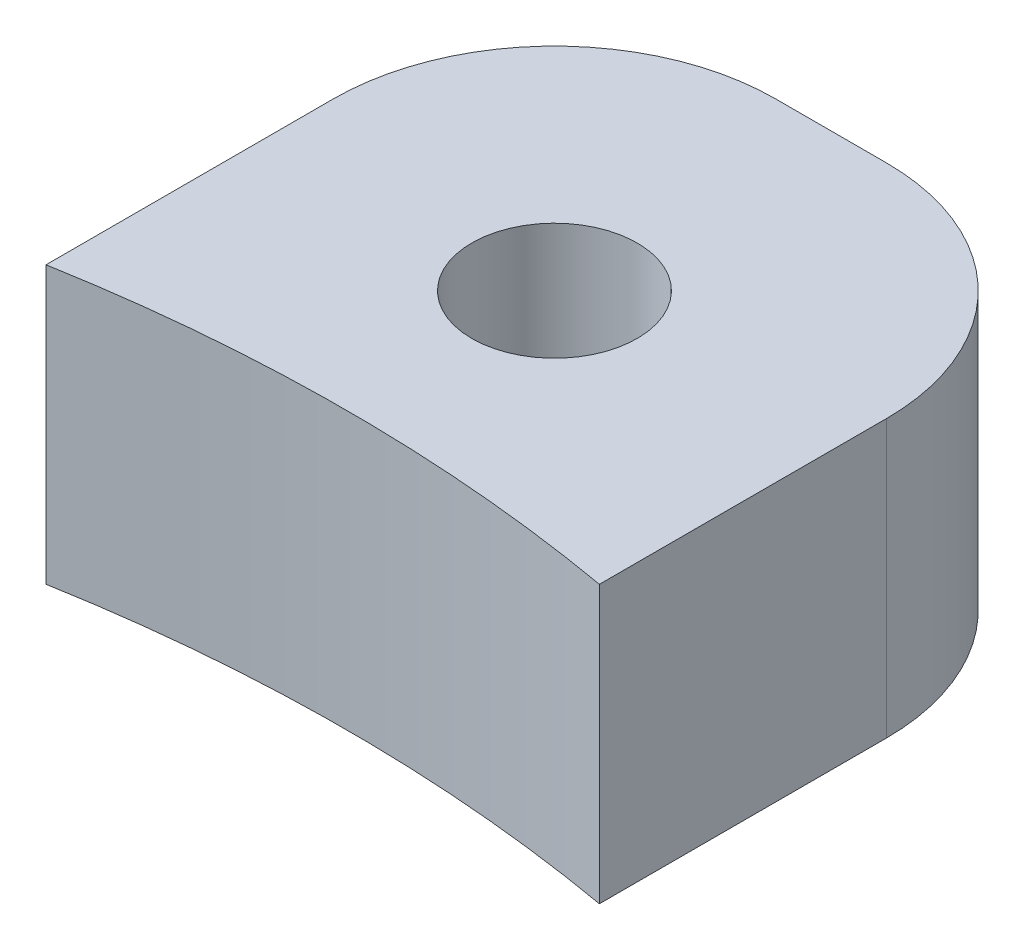
ISO-10303-21;
HEADER;
FILE_DESCRIPTION(('STEP AP214'),'2;1');
FILE_NAME('part.step','',(''),(''),'','','');
FILE_SCHEMA(('AUTOMOTIVE_DESIGN { 1 0 10303 214 1 1 1 1 }'));
ENDSEC;
DATA;
#1=APPLICATION_CONTEXT('core data for automotive mechanical design processes');
#2=APPLICATION_PROTOCOL_DEFINITION('international standard','automotive_design',2000,#1);
#3=PRODUCT_CONTEXT('',#1,'mechanical');
#4=PRODUCT('Part','Part','',(#3));
#5=PRODUCT_RELATED_PRODUCT_CATEGORY('part','',(#4));
#6=PRODUCT_DEFINITION_FORMATION('','',#4);
#7=PRODUCT_DEFINITION_CONTEXT('part definition',#1,'design');
#8=PRODUCT_DEFINITION('design','',#6,#7);
#9=PRODUCT_DEFINITION_SHAPE('','',#8);
#10=(LENGTH_UNIT() NAMED_UNIT(*) SI_UNIT(.MILLI.,.METRE.));
#11=(NAMED_UNIT(*) PLANE_ANGLE_UNIT() SI_UNIT($,.RADIAN.));
#12=(NAMED_UNIT(*) SI_UNIT($,.STERADIAN.) SOLID_ANGLE_UNIT());
#13=UNCERTAINTY_MEASURE_WITH_UNIT(LENGTH_MEASURE(1.E-05),#10,'distance_accuracy_value','');
#14=(GEOMETRIC_REPRESENTATION_CONTEXT(3) GLOBAL_UNCERTAINTY_ASSIGNED_CONTEXT((#13)) GLOBAL_UNIT_ASSIGNED_CONTEXT((#10,
#11,#12)) REPRESENTATION_CONTEXT('',''));
#15=CARTESIAN_POINT('',(0.,0.,0.));
#16=DIRECTION('',(0.,0.,1.));
#17=DIRECTION('',(1.,0.,0.));
#18=AXIS2_PLACEMENT_3D('',#15,#16,#17);
#19=CARTESIAN_POINT('',(6.35,6.35,-17.145));
#20=DIRECTION('',(-1.,0.,0.));
#21=DIRECTION('',(0.,0.,1.));
#22=AXIS2_PLACEMENT_3D('',#19,#20,#21);
#23=PLANE('',#22);
#24=DIRECTION('',(0.,0.,-1.));
#25=VECTOR('',#24,1.);
#26=CARTESIAN_POINT('',(6.35,6.35,-17.145));
#27=LINE('',#26,#25);
#28=CARTESIAN_POINT('',(6.35,6.35,-10.5560864979769));
#29=VERTEX_POINT('',#28);
#30=CARTESIAN_POINT('',(6.35,6.35,-17.145));
#31=VERTEX_POINT('',#30);
#32=EDGE_CURVE('E101',#29,#31,#27,.T.);
#33=ORIENTED_EDGE('',*,*,#32,.F.);
#34=DIRECTION('',(0.,1.,0.));
#35=VECTOR('',#34,1.);
#36=CARTESIAN_POINT('',(6.35,0.,-10.5560864979769));
#37=LINE('',#36,#35);
#38=CARTESIAN_POINT('',(6.35,0.,-10.5560864979769));
#39=VERTEX_POINT('',#38);
#40=EDGE_CURVE('E88',#29,#39,#37,.F.);
#41=ORIENTED_EDGE('',*,*,#40,.T.);
#42=DIRECTION('',(0.,0.,-1.));
#43=VECTOR('',#42,1.);
#44=CARTESIAN_POINT('',(6.35,0.,-17.145));
#45=LINE('',#44,#43);
#46=CARTESIAN_POINT('',(6.35,0.,-17.145));
#47=VERTEX_POINT('',#46);
#48=EDGE_CURVE('E99',#39,#47,#45,.T.);
#49=ORIENTED_EDGE('',*,*,#48,.T.);
#50=DIRECTION('',(0.,-1.,0.));
#51=VECTOR('',#50,1.);
#52=CARTESIAN_POINT('',(6.35,6.35,-17.145));
#53=LINE('',#52,#51);
#54=EDGE_CURVE('E11',#31,#47,#53,.T.);
#55=ORIENTED_EDGE('',*,*,#54,.F.);
#56=EDGE_LOOP('',(#33,#41,#49,#55));
#57=FACE_BOUND('',#56,.T.);
#58=ADVANCED_FACE('F34',(#57),#23,.F.);
#59=CARTESIAN_POINT('',(1.27,6.35,-17.145));
#60=DIRECTION('',(0.,-1.,0.));
#61=DIRECTION('',(0.,0.,-1.));
#62=AXIS2_PLACEMENT_3D('',#59,#60,#61);
#63=CYLINDRICAL_SURFACE('',#62,5.08);
#64=CARTESIAN_POINT('',(1.27,0.,-17.145));
#65=DIRECTION('',(0.,1.,0.));
#66=DIRECTION('',(0.,0.,1.));
#67=AXIS2_PLACEMENT_3D('',#64,#65,#66);
#68=CIRCLE('',#67,5.08);
#69=CARTESIAN_POINT('',(1.27,0.,-22.225));
#70=VERTEX_POINT('',#69);
#71=EDGE_CURVE('E105',#47,#70,#68,.T.);
#72=ORIENTED_EDGE('',*,*,#71,.T.);
#73=DIRECTION('',(0.,-1.,0.));
#74=VECTOR('',#73,1.);
#75=CARTESIAN_POINT('',(1.27,6.35,-22.225));
#76=LINE('',#75,#74);
#77=CARTESIAN_POINT('',(1.27,6.35,-22.225));
#78=VERTEX_POINT('',#77);
#79=EDGE_CURVE('E42',#78,#70,#76,.T.);
#80=ORIENTED_EDGE('',*,*,#79,.F.);
#81=CARTESIAN_POINT('',(1.27,6.35,-17.145));
#82=DIRECTION('',(0.,1.,0.));
#83=DIRECTION('',(0.,0.,1.));
#84=AXIS2_PLACEMENT_3D('',#81,#82,#83);
#85=CIRCLE('',#84,5.08);
#86=EDGE_CURVE('E117',#31,#78,#85,.T.);
#87=ORIENTED_EDGE('',*,*,#86,.F.);
#88=ORIENTED_EDGE('',*,*,#54,.T.);
#89=EDGE_LOOP('',(#72,#80,#87,#88));
#90=FACE_BOUND('',#89,.T.);
#91=ADVANCED_FACE('F165',(#90),#63,.T.);
#92=CARTESIAN_POINT('',(-1.27,6.35,-22.225));
#93=DIRECTION('',(0.,0.,1.));
#94=DIRECTION('',(1.,0.,0.));
#95=AXIS2_PLACEMENT_3D('',#92,#93,#94);
#96=PLANE('',#95);
#97=DIRECTION('',(-1.,0.,0.));
#98=VECTOR('',#97,1.);
#99=CARTESIAN_POINT('',(-1.27,0.,-22.225));
#100=LINE('',#99,#98);
#101=CARTESIAN_POINT('',(-1.27,0.,-22.225));
#102=VERTEX_POINT('',#101);
#103=EDGE_CURVE('E107',#70,#102,#100,.T.);
#104=ORIENTED_EDGE('',*,*,#103,.T.);
#105=DIRECTION('',(0.,-1.,0.));
#106=VECTOR('',#105,1.);
#107=CARTESIAN_POINT('',(-1.27,6.35,-22.225));
#108=LINE('',#107,#106);
#109=CARTESIAN_POINT('',(-1.27,6.35,-22.225));
#110=VERTEX_POINT('',#109);
#111=EDGE_CURVE('E127',#110,#102,#108,.T.);
#112=ORIENTED_EDGE('',*,*,#111,.F.);
#113=DIRECTION('',(-1.,0.,0.));
#114=VECTOR('',#113,1.);
#115=CARTESIAN_POINT('',(-1.27,6.35,-22.225));
#116=LINE('',#115,#114);
#117=EDGE_CURVE('E119',#78,#110,#116,.T.);
#118=ORIENTED_EDGE('',*,*,#117,.F.);
#119=ORIENTED_EDGE('',*,*,#79,.T.);
#120=EDGE_LOOP('',(#104,#112,#118,#119));
#121=FACE_BOUND('',#120,.T.);
#122=ADVANCED_FACE('F134',(#121),#96,.F.);
#123=CARTESIAN_POINT('',(-1.27,6.35,-17.145));
#124=DIRECTION('',(0.,-1.,0.));
#125=DIRECTION('',(0.,0.,-1.));
#126=AXIS2_PLACEMENT_3D('',#123,#124,#125);
#127=CYLINDRICAL_SURFACE('',#126,5.08);
#128=CARTESIAN_POINT('',(-1.27,0.,-17.145));
#129=DIRECTION('',(0.,1.,0.));
#130=DIRECTION('',(0.,0.,1.));
#131=AXIS2_PLACEMENT_3D('',#128,#129,#130);
#132=CIRCLE('',#131,5.08);
#133=CARTESIAN_POINT('',(-6.35,0.,-17.145));
#134=VERTEX_POINT('',#133);
#135=EDGE_CURVE('E112',#102,#134,#132,.T.);
#136=ORIENTED_EDGE('',*,*,#135,.T.);
#137=DIRECTION('',(0.,-1.,0.));
#138=VECTOR('',#137,1.);
#139=CARTESIAN_POINT('',(-6.35,6.35,-17.145));
#140=LINE('',#139,#138);
#141=CARTESIAN_POINT('',(-6.35,6.35,-17.145));
#142=VERTEX_POINT('',#141);
#143=EDGE_CURVE('E124',#142,#134,#140,.T.);
#144=ORIENTED_EDGE('',*,*,#143,.F.);
#145=CARTESIAN_POINT('',(-1.27,6.35,-17.145));
#146=DIRECTION('',(0.,1.,0.));
#147=DIRECTION('',(0.,0.,1.));
#148=AXIS2_PLACEMENT_3D('',#145,#146,#147);
#149=CIRCLE('',#148,5.08);
#150=EDGE_CURVE('E57',#110,#142,#149,.T.);
#151=ORIENTED_EDGE('',*,*,#150,.F.);
#152=ORIENTED_EDGE('',*,*,#111,.T.);
#153=EDGE_LOOP('',(#136,#144,#151,#152));
#154=FACE_BOUND('',#153,.T.);
#155=ADVANCED_FACE('F140',(#154),#127,.T.);
#156=CARTESIAN_POINT('',(-6.35,6.35,-17.145));
#157=DIRECTION('',(1.,0.,0.));
#158=DIRECTION('',(0.,0.,-1.));
#159=AXIS2_PLACEMENT_3D('',#156,#157,#158);
#160=PLANE('',#159);
#161=DIRECTION('',(0.,0.,1.));
#162=VECTOR('',#161,1.);
#163=CARTESIAN_POINT('',(-6.35,0.,-17.145));
#164=LINE('',#163,#162);
#165=CARTESIAN_POINT('',(-6.35,0.,-10.5560864979769));
#166=VERTEX_POINT('',#165);
#167=EDGE_CURVE('E114',#134,#166,#164,.T.);
#168=ORIENTED_EDGE('',*,*,#167,.T.);
#169=DIRECTION('',(0.,1.,0.));
#170=VECTOR('',#169,1.);
#171=CARTESIAN_POINT('',(-6.35,0.,-10.5560864979769));
#172=LINE('',#171,#170);
#173=CARTESIAN_POINT('',(-6.35,6.35,-10.5560864979769));
#174=VERTEX_POINT('',#173);
#175=EDGE_CURVE('E49',#166,#174,#172,.T.);
#176=ORIENTED_EDGE('',*,*,#175,.T.);
#177=DIRECTION('',(0.,0.,1.));
#178=VECTOR('',#177,1.);
#179=CARTESIAN_POINT('',(-6.35,6.35,-17.145));
#180=LINE('',#179,#178);
#181=EDGE_CURVE('E122',#142,#174,#180,.T.);
#182=ORIENTED_EDGE('',*,*,#181,.F.);
#183=ORIENTED_EDGE('',*,*,#143,.T.);
#184=EDGE_LOOP('',(#168,#176,#182,#183));
#185=FACE_BOUND('',#184,.T.);
#186=ADVANCED_FACE('F143',(#185),#160,.F.);
#187=CARTESIAN_POINT('',(-1.27,6.35,-17.145));
#188=DIRECTION('',(0.,1.,0.));
#189=DIRECTION('',(0.,0.,1.));
#190=AXIS2_PLACEMENT_3D('',#187,#188,#189);
#191=PLANE('',#190);
#192=CARTESIAN_POINT('',(0.,6.35,-15.875));
#193=DIRECTION('',(0.,1.,0.));
#194=DIRECTION('',(0.,0.,1.));
#195=AXIS2_PLACEMENT_3D('',#192,#193,#194);
#196=CIRCLE('',#195,1.89864999999996);
#197=CARTESIAN_POINT('',(0.,6.35,-13.97635));
#198=VERTEX_POINT('',#197);
#199=EDGE_CURVE('E147',#198,#198,#196,.T.);
#200=ORIENTED_EDGE('',*,*,#199,.F.);
#201=EDGE_LOOP('',(#200));
#202=FACE_BOUND('',#201,.T.);
#203=CARTESIAN_POINT('',(0.,6.35,25.4));
#204=DIRECTION('',(0.,1.,0.));
#205=DIRECTION('',(0.,0.,1.));
#206=AXIS2_PLACEMENT_3D('',#203,#204,#205);
#207=CIRCLE('',#206,36.5125);
#208=EDGE_CURVE('E94',#29,#174,#207,.T.);
#209=ORIENTED_EDGE('',*,*,#208,.F.);
#210=ORIENTED_EDGE('',*,*,#32,.T.);
#211=ORIENTED_EDGE('',*,*,#86,.T.);
#212=ORIENTED_EDGE('',*,*,#117,.T.);
#213=ORIENTED_EDGE('',*,*,#150,.T.);
#214=ORIENTED_EDGE('',*,*,#181,.T.);
#215=EDGE_LOOP('',(#209,#210,#211,#212,#213,#214));
#216=FACE_BOUND('',#215,.T.);
#217=ADVANCED_FACE('F144',(#202,#216),#191,.T.);
#218=CARTESIAN_POINT('',(-1.27,0.,-17.145));
#219=DIRECTION('',(0.,1.,0.));
#220=DIRECTION('',(0.,0.,1.));
#221=AXIS2_PLACEMENT_3D('',#218,#219,#220);
#222=PLANE('',#221);
#223=CARTESIAN_POINT('',(0.,0.,-15.875));
#224=DIRECTION('',(0.,1.,0.));
#225=DIRECTION('',(0.,0.,1.));
#226=AXIS2_PLACEMENT_3D('',#223,#224,#225);
#227=CIRCLE('',#226,1.89864999999994);
#228=CARTESIAN_POINT('',(0.,0.,-13.9763500000001));
#229=VERTEX_POINT('',#228);
#230=EDGE_CURVE('E37',#229,#229,#227,.T.);
#231=ORIENTED_EDGE('',*,*,#230,.T.);
#232=EDGE_LOOP('',(#231));
#233=FACE_BOUND('',#232,.T.);
#234=ORIENTED_EDGE('',*,*,#48,.F.);
#235=CARTESIAN_POINT('',(0.,0.,25.4));
#236=DIRECTION('',(0.,1.,0.));
#237=DIRECTION('',(0.,0.,1.));
#238=AXIS2_PLACEMENT_3D('',#235,#236,#237);
#239=CIRCLE('',#238,36.5125);
#240=EDGE_CURVE('E85',#39,#166,#239,.T.);
#241=ORIENTED_EDGE('',*,*,#240,.T.);
#242=ORIENTED_EDGE('',*,*,#167,.F.);
#243=ORIENTED_EDGE('',*,*,#135,.F.);
#244=ORIENTED_EDGE('',*,*,#103,.F.);
#245=ORIENTED_EDGE('',*,*,#71,.F.);
#246=EDGE_LOOP('',(#234,#241,#242,#243,#244,#245));
#247=FACE_BOUND('',#246,.T.);
#248=ADVANCED_FACE('F103',(#233,#247),#222,.F.);
#249=CARTESIAN_POINT('',(0.,0.,25.4));
#250=DIRECTION('',(0.,1.,0.));
#251=DIRECTION('',(0.,0.,1.));
#252=AXIS2_PLACEMENT_3D('',#249,#250,#251);
#253=CYLINDRICAL_SURFACE('',#252,36.5125);
#254=ORIENTED_EDGE('',*,*,#208,.T.);
#255=ORIENTED_EDGE('',*,*,#175,.F.);
#256=ORIENTED_EDGE('',*,*,#240,.F.);
#257=ORIENTED_EDGE('',*,*,#40,.F.);
#258=EDGE_LOOP('',(#254,#255,#256,#257));
#259=FACE_BOUND('',#258,.T.);
#260=ADVANCED_FACE('F87',(#259),#253,.F.);
#261=CARTESIAN_POINT('',(0.,6.35,-15.875));
#262=DIRECTION('',(0.,1.,0.));
#263=DIRECTION('',(0.,0.,1.));
#264=AXIS2_PLACEMENT_3D('',#261,#262,#263);
#265=CYLINDRICAL_SURFACE('',#264,1.89864999999994);
#266=ORIENTED_EDGE('',*,*,#199,.T.);
#267=EDGE_LOOP('',(#266));
#268=FACE_BOUND('',#267,.T.);
#269=ORIENTED_EDGE('',*,*,#230,.F.);
#270=EDGE_LOOP('',(#269));
#271=FACE_BOUND('',#270,.T.);
#272=ADVANCED_FACE('F152',(#268,#271),#265,.F.);
#273=CLOSED_SHELL('',(#58,#91,#122,#155,#186,#217,#248,#260,#272));
#274=MANIFOLD_SOLID_BREP('B2',#273);
#275=ADVANCED_BREP_SHAPE_REPRESENTATION('',(#18,#274),#14);
#276=SHAPE_DEFINITION_REPRESENTATION(#9,#275);
ENDSEC;
END-ISO-10303-21;
